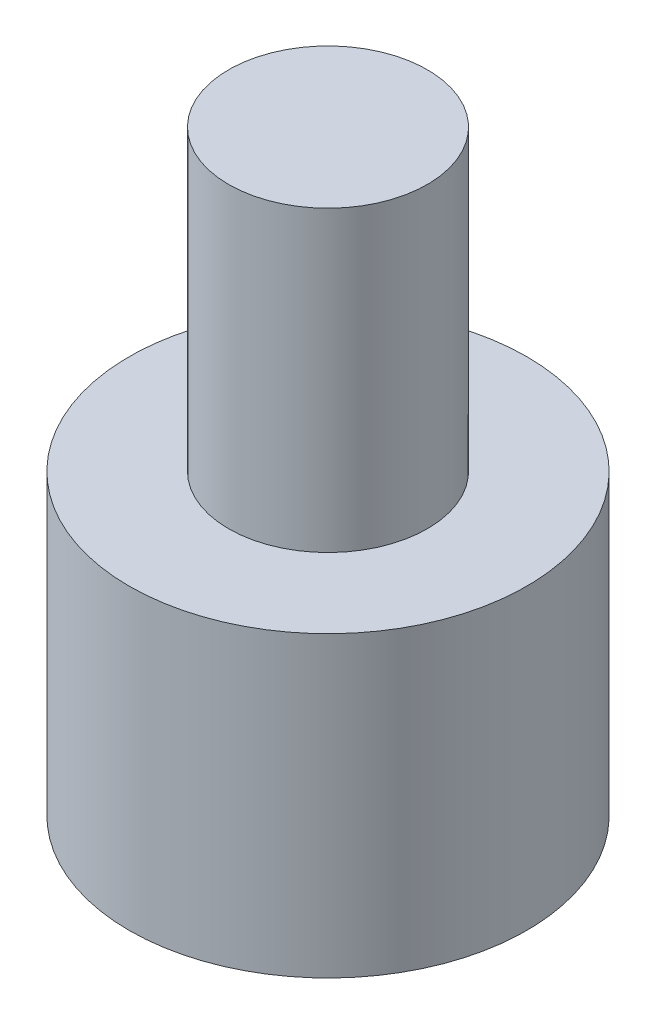
ISO-10303-21;
HEADER;
FILE_DESCRIPTION(('STEP AP214'),'2;1');
FILE_NAME('part.step','',(''),(''),'','','');
FILE_SCHEMA(('AUTOMOTIVE_DESIGN { 1 0 10303 214 1 1 1 1 }'));
ENDSEC;
DATA;
#1=APPLICATION_CONTEXT('core data for automotive mechanical design processes');
#2=APPLICATION_PROTOCOL_DEFINITION('international standard','automotive_design',2000,#1);
#3=PRODUCT_CONTEXT('',#1,'mechanical');
#4=PRODUCT('Part','Part','',(#3));
#5=PRODUCT_RELATED_PRODUCT_CATEGORY('part','',(#4));
#6=PRODUCT_DEFINITION_FORMATION('','',#4);
#7=PRODUCT_DEFINITION_CONTEXT('part definition',#1,'design');
#8=PRODUCT_DEFINITION('design','',#6,#7);
#9=PRODUCT_DEFINITION_SHAPE('','',#8);
#10=(LENGTH_UNIT() NAMED_UNIT(*) SI_UNIT(.MILLI.,.METRE.));
#11=(NAMED_UNIT(*) PLANE_ANGLE_UNIT() SI_UNIT($,.RADIAN.));
#12=(NAMED_UNIT(*) SI_UNIT($,.STERADIAN.) SOLID_ANGLE_UNIT());
#13=UNCERTAINTY_MEASURE_WITH_UNIT(LENGTH_MEASURE(1.E-05),#10,'distance_accuracy_value','');
#14=(GEOMETRIC_REPRESENTATION_CONTEXT(3) GLOBAL_UNCERTAINTY_ASSIGNED_CONTEXT((#13)) GLOBAL_UNIT_ASSIGNED_CONTEXT((#10,
#11,#12)) REPRESENTATION_CONTEXT('',''));
#15=CARTESIAN_POINT('',(0.,0.,0.));
#16=DIRECTION('',(0.,0.,1.));
#17=DIRECTION('',(1.,0.,0.));
#18=AXIS2_PLACEMENT_3D('',#15,#16,#17);
#19=CARTESIAN_POINT('',(0.,30.,0.));
#20=DIRECTION('',(0.,-1.,0.));
#21=DIRECTION('',(0.,0.,-1.));
#22=AXIS2_PLACEMENT_3D('',#19,#20,#21);
#23=CYLINDRICAL_SURFACE('',#22,20.);
#24=CARTESIAN_POINT('',(0.,30.,0.));
#25=DIRECTION('',(0.,1.,0.));
#26=DIRECTION('',(0.,0.,1.));
#27=AXIS2_PLACEMENT_3D('',#24,#25,#26);
#28=CIRCLE('',#27,20.);
#29=CARTESIAN_POINT('',(0.,30.,20.));
#30=VERTEX_POINT('',#29);
#31=EDGE_CURVE('E47',#30,#30,#28,.T.);
#32=ORIENTED_EDGE('',*,*,#31,.F.);
#33=EDGE_LOOP('',(#32));
#34=FACE_BOUND('',#33,.T.);
#35=CARTESIAN_POINT('',(0.,0.,0.));
#36=DIRECTION('',(0.,1.,0.));
#37=DIRECTION('',(0.,0.,1.));
#38=AXIS2_PLACEMENT_3D('',#35,#36,#37);
#39=CIRCLE('',#38,20.);
#40=CARTESIAN_POINT('',(0.,0.,20.));
#41=VERTEX_POINT('',#40);
#42=EDGE_CURVE('E42',#41,#41,#39,.T.);
#43=ORIENTED_EDGE('',*,*,#42,.T.);
#44=EDGE_LOOP('',(#43));
#45=FACE_BOUND('',#44,.T.);
#46=ADVANCED_FACE('F39',(#34,#45),#23,.T.);
#47=CARTESIAN_POINT('',(0.,30.,0.));
#48=DIRECTION('',(0.,1.,0.));
#49=DIRECTION('',(0.,0.,1.));
#50=AXIS2_PLACEMENT_3D('',#47,#48,#49);
#51=PLANE('',#50);
#52=CARTESIAN_POINT('',(0.,30.,0.));
#53=DIRECTION('',(0.,1.,0.));
#54=DIRECTION('',(0.,0.,1.));
#55=AXIS2_PLACEMENT_3D('',#52,#53,#54);
#56=CIRCLE('',#55,10.);
#57=CARTESIAN_POINT('',(0.,30.,10.));
#58=VERTEX_POINT('',#57);
#59=EDGE_CURVE('E10',#58,#58,#56,.T.);
#60=ORIENTED_EDGE('',*,*,#59,.F.);
#61=EDGE_LOOP('',(#60));
#62=FACE_BOUND('',#61,.T.);
#63=ORIENTED_EDGE('',*,*,#31,.T.);
#64=EDGE_LOOP('',(#63));
#65=FACE_BOUND('',#64,.T.);
#66=ADVANCED_FACE('F67',(#62,#65),#51,.T.);
#67=CARTESIAN_POINT('',(0.,0.,0.));
#68=DIRECTION('',(0.,1.,0.));
#69=DIRECTION('',(0.,0.,1.));
#70=AXIS2_PLACEMENT_3D('',#67,#68,#69);
#71=PLANE('',#70);
#72=ORIENTED_EDGE('',*,*,#42,.F.);
#73=EDGE_LOOP('',(#72));
#74=FACE_BOUND('',#73,.T.);
#75=ADVANCED_FACE('F64',(#74),#71,.F.);
#76=CARTESIAN_POINT('',(0.,60.,0.));
#77=DIRECTION('',(0.,-1.,0.));
#78=DIRECTION('',(0.,0.,-1.));
#79=AXIS2_PLACEMENT_3D('',#76,#77,#78);
#80=CYLINDRICAL_SURFACE('',#79,10.);
#81=CARTESIAN_POINT('',(0.,60.,0.));
#82=DIRECTION('',(0.,1.,0.));
#83=DIRECTION('',(0.,0.,1.));
#84=AXIS2_PLACEMENT_3D('',#81,#82,#83);
#85=CIRCLE('',#84,10.);
#86=CARTESIAN_POINT('',(0.,60.,10.));
#87=VERTEX_POINT('',#86);
#88=EDGE_CURVE('E54',#87,#87,#85,.T.);
#89=ORIENTED_EDGE('',*,*,#88,.F.);
#90=EDGE_LOOP('',(#89));
#91=FACE_BOUND('',#90,.T.);
#92=ORIENTED_EDGE('',*,*,#59,.T.);
#93=EDGE_LOOP('',(#92));
#94=FACE_BOUND('',#93,.T.);
#95=ADVANCED_FACE('F66',(#91,#94),#80,.T.);
#96=CARTESIAN_POINT('',(0.,60.,0.));
#97=DIRECTION('',(0.,1.,0.));
#98=DIRECTION('',(0.,0.,1.));
#99=AXIS2_PLACEMENT_3D('',#96,#97,#98);
#100=PLANE('',#99);
#101=ORIENTED_EDGE('',*,*,#88,.T.);
#102=EDGE_LOOP('',(#101));
#103=FACE_BOUND('',#102,.T.);
#104=ADVANCED_FACE('F72',(#103),#100,.T.);
#105=CLOSED_SHELL('',(#46,#66,#75,#95,#104));
#106=MANIFOLD_SOLID_BREP('B2',#105);
#107=ADVANCED_BREP_SHAPE_REPRESENTATION('',(#18,#106),#14);
#108=SHAPE_DEFINITION_REPRESENTATION(#9,#107);
ENDSEC;
END-ISO-10303-21;
